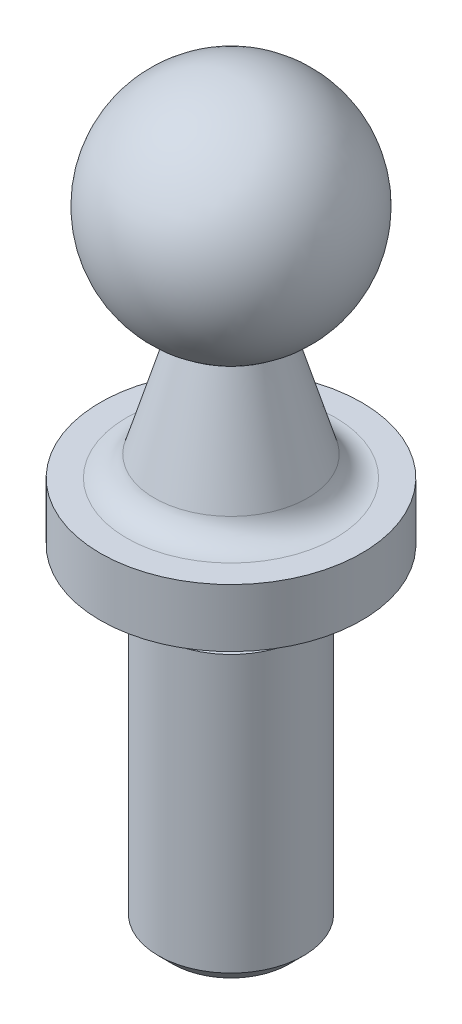
ISO-10303-21;
HEADER;
FILE_DESCRIPTION(('STEP AP214'),'2;1');
FILE_NAME('part.step','',(''),(''),'','','');
FILE_SCHEMA(('AUTOMOTIVE_DESIGN { 1 0 10303 214 1 1 1 1 }'));
ENDSEC;
DATA;
#1=APPLICATION_CONTEXT('core data for automotive mechanical design processes');
#2=APPLICATION_PROTOCOL_DEFINITION('international standard','automotive_design',2000,#1);
#3=PRODUCT_CONTEXT('',#1,'mechanical');
#4=PRODUCT('Part','Part','',(#3));
#5=PRODUCT_RELATED_PRODUCT_CATEGORY('part','',(#4));
#6=PRODUCT_DEFINITION_FORMATION('','',#4);
#7=PRODUCT_DEFINITION_CONTEXT('part definition',#1,'design');
#8=PRODUCT_DEFINITION('design','',#6,#7);
#9=PRODUCT_DEFINITION_SHAPE('','',#8);
#10=(LENGTH_UNIT() NAMED_UNIT(*) SI_UNIT(.MILLI.,.METRE.));
#11=(NAMED_UNIT(*) PLANE_ANGLE_UNIT() SI_UNIT($,.RADIAN.));
#12=(NAMED_UNIT(*) SI_UNIT($,.STERADIAN.) SOLID_ANGLE_UNIT());
#13=UNCERTAINTY_MEASURE_WITH_UNIT(LENGTH_MEASURE(1.E-05),#10,'distance_accuracy_value','');
#14=(GEOMETRIC_REPRESENTATION_CONTEXT(3) GLOBAL_UNCERTAINTY_ASSIGNED_CONTEXT((#13)) GLOBAL_UNIT_ASSIGNED_CONTEXT((#10,
#11,#12)) REPRESENTATION_CONTEXT('',''));
#15=CARTESIAN_POINT('',(0.,0.,0.));
#16=DIRECTION('',(0.,0.,1.));
#17=DIRECTION('',(1.,0.,0.));
#18=AXIS2_PLACEMENT_3D('',#15,#16,#17);
#19=CARTESIAN_POINT('',(0.,-3.9,0.));
#20=DIRECTION('',(0.,1.,0.));
#21=DIRECTION('',(1.,0.,0.));
#22=AXIS2_PLACEMENT_3D('',#19,#20,#21);
#23=SPHERICAL_SURFACE('',#22,3.9);
#24=CARTESIAN_POINT('',(0.,-7.5,0.));
#25=DIRECTION('',(0.,1.,0.));
#26=DIRECTION('',(0.,0.,1.));
#27=AXIS2_PLACEMENT_3D('',#24,#25,#26);
#28=CIRCLE('',#27,1.5);
#29=CARTESIAN_POINT('',(0.,-7.5,1.5));
#30=VERTEX_POINT('',#29);
#31=EDGE_CURVE('E44',#30,#30,#28,.T.);
#32=ORIENTED_EDGE('',*,*,#31,.T.);
#33=EDGE_LOOP('',(#32));
#34=FACE_BOUND('',#33,.T.);
#35=ADVANCED_FACE('F25',(#34),#23,.T.);
#36=CARTESIAN_POINT('',(0.,-12.,0.));
#37=DIRECTION('',(0.,-1.,0.));
#38=DIRECTION('',(0.,0.,-1.));
#39=AXIS2_PLACEMENT_3D('',#36,#37,#38);
#40=CONICAL_SURFACE('',#39,2.85,0.291456794477867);
#41=CARTESIAN_POINT('',(0.,-11.2873478855663,0.));
#42=DIRECTION('',(0.,-1.,0.));
#43=DIRECTION('',(0.,0.,-1.));
#44=AXIS2_PLACEMENT_3D('',#41,#42,#43);
#45=CIRCLE('',#44,2.63620436566991);
#46=CARTESIAN_POINT('',(0.,-11.2873478855663,-2.63620436566991));
#47=VERTEX_POINT('',#46);
#48=EDGE_CURVE('E39',#47,#47,#45,.F.);
#49=ORIENTED_EDGE('',*,*,#48,.T.);
#50=EDGE_LOOP('',(#49));
#51=FACE_BOUND('',#50,.T.);
#52=ORIENTED_EDGE('',*,*,#31,.F.);
#53=EDGE_LOOP('',(#52));
#54=FACE_BOUND('',#53,.T.);
#55=ADVANCED_FACE('F79',(#51,#54),#40,.T.);
#56=CARTESIAN_POINT('',(2.85,-12.,0.));
#57=DIRECTION('',(0.,-1.,0.));
#58=DIRECTION('',(0.,0.,-1.));
#59=AXIS2_PLACEMENT_3D('',#56,#57,#58);
#60=PLANE('',#59);
#61=CARTESIAN_POINT('',(0.,-12.,0.));
#62=DIRECTION('',(0.,-1.,0.));
#63=DIRECTION('',(0.,0.,-1.));
#64=AXIS2_PLACEMENT_3D('',#61,#62,#63);
#65=CIRCLE('',#64,3.59403065089106);
#66=CARTESIAN_POINT('',(0.,-12.,-3.59403065089106));
#67=VERTEX_POINT('',#66);
#68=EDGE_CURVE('E35',#67,#67,#65,.T.);
#69=ORIENTED_EDGE('',*,*,#68,.T.);
#70=EDGE_LOOP('',(#69));
#71=FACE_BOUND('',#70,.T.);
#72=CARTESIAN_POINT('',(0.,-12.,0.));
#73=DIRECTION('',(0.,1.,0.));
#74=DIRECTION('',(0.,0.,1.));
#75=AXIS2_PLACEMENT_3D('',#72,#73,#74);
#76=CIRCLE('',#75,4.5);
#77=CARTESIAN_POINT('',(0.,-12.,4.5));
#78=VERTEX_POINT('',#77);
#79=EDGE_CURVE('E47',#78,#78,#76,.T.);
#80=ORIENTED_EDGE('',*,*,#79,.T.);
#81=EDGE_LOOP('',(#80));
#82=FACE_BOUND('',#81,.T.);
#83=ADVANCED_FACE('F84',(#71,#82),#60,.F.);
#84=CARTESIAN_POINT('',(0.,10.1876179194703,0.));
#85=DIRECTION('',(0.,1.,0.));
#86=DIRECTION('',(0.,0.,1.));
#87=AXIS2_PLACEMENT_3D('',#84,#85,#86);
#88=CYLINDRICAL_SURFACE('',#87,4.5);
#89=ORIENTED_EDGE('',*,*,#79,.F.);
#90=EDGE_LOOP('',(#89));
#91=FACE_BOUND('',#90,.T.);
#92=CARTESIAN_POINT('',(0.,-14.,0.));
#93=DIRECTION('',(0.,1.,0.));
#94=DIRECTION('',(0.,0.,1.));
#95=AXIS2_PLACEMENT_3D('',#92,#93,#94);
#96=CIRCLE('',#95,4.5);
#97=CARTESIAN_POINT('',(0.,-14.,4.5));
#98=VERTEX_POINT('',#97);
#99=EDGE_CURVE('E50',#98,#98,#96,.T.);
#100=ORIENTED_EDGE('',*,*,#99,.T.);
#101=EDGE_LOOP('',(#100));
#102=FACE_BOUND('',#101,.T.);
#103=ADVANCED_FACE('F91',(#91,#102),#88,.T.);
#104=CARTESIAN_POINT('',(2.5,-14.,0.));
#105=DIRECTION('',(0.,1.,0.));
#106=DIRECTION('',(0.,0.,1.));
#107=AXIS2_PLACEMENT_3D('',#104,#105,#106);
#108=PLANE('',#107);
#109=ORIENTED_EDGE('',*,*,#99,.F.);
#110=EDGE_LOOP('',(#109));
#111=FACE_BOUND('',#110,.T.);
#112=CARTESIAN_POINT('',(0.,-14.,0.));
#113=DIRECTION('',(0.,1.,0.));
#114=DIRECTION('',(0.,0.,1.));
#115=AXIS2_PLACEMENT_3D('',#112,#113,#114);
#116=CIRCLE('',#115,2.0024349269423);
#117=CARTESIAN_POINT('',(0.,-14.,2.0024349269423));
#118=VERTEX_POINT('',#117);
#119=EDGE_CURVE('E53',#118,#118,#116,.T.);
#120=ORIENTED_EDGE('',*,*,#119,.T.);
#121=EDGE_LOOP('',(#120));
#122=FACE_BOUND('',#121,.T.);
#123=ADVANCED_FACE('F97',(#111,#122),#108,.F.);
#124=CARTESIAN_POINT('',(0.,10.1876179194703,0.));
#125=DIRECTION('',(0.,1.,0.));
#126=DIRECTION('',(0.,0.,1.));
#127=AXIS2_PLACEMENT_3D('',#124,#125,#126);
#128=CYLINDRICAL_SURFACE('',#127,2.0024349269423);
#129=ORIENTED_EDGE('',*,*,#119,.F.);
#130=EDGE_LOOP('',(#129));
#131=FACE_BOUND('',#130,.T.);
#132=CARTESIAN_POINT('',(0.,-15.5,0.));
#133=DIRECTION('',(0.,1.,0.));
#134=DIRECTION('',(0.,0.,1.));
#135=AXIS2_PLACEMENT_3D('',#132,#133,#134);
#136=CIRCLE('',#135,2.0024349269423);
#137=CARTESIAN_POINT('',(0.,-15.5,2.0024349269423));
#138=VERTEX_POINT('',#137);
#139=EDGE_CURVE('E56',#138,#138,#136,.T.);
#140=ORIENTED_EDGE('',*,*,#139,.T.);
#141=EDGE_LOOP('',(#140));
#142=FACE_BOUND('',#141,.T.);
#143=ADVANCED_FACE('F75',(#131,#142),#128,.T.);
#144=CARTESIAN_POINT('',(2.0024349269423,-15.5,0.));
#145=DIRECTION('',(0.,-1.,0.));
#146=DIRECTION('',(0.,0.,-1.));
#147=AXIS2_PLACEMENT_3D('',#144,#145,#146);
#148=PLANE('',#147);
#149=ORIENTED_EDGE('',*,*,#139,.F.);
#150=EDGE_LOOP('',(#149));
#151=FACE_BOUND('',#150,.T.);
#152=CARTESIAN_POINT('',(0.,-15.5,0.));
#153=DIRECTION('',(0.,1.,0.));
#154=DIRECTION('',(0.,0.,1.));
#155=AXIS2_PLACEMENT_3D('',#152,#153,#154);
#156=CIRCLE('',#155,2.5);
#157=CARTESIAN_POINT('',(0.,-15.5,2.5));
#158=VERTEX_POINT('',#157);
#159=EDGE_CURVE('E59',#158,#158,#156,.T.);
#160=ORIENTED_EDGE('',*,*,#159,.T.);
#161=EDGE_LOOP('',(#160));
#162=FACE_BOUND('',#161,.T.);
#163=ADVANCED_FACE('F63',(#151,#162),#148,.F.);
#164=CARTESIAN_POINT('',(0.,10.1876179194703,0.));
#165=DIRECTION('',(0.,1.,0.));
#166=DIRECTION('',(0.,0.,1.));
#167=AXIS2_PLACEMENT_3D('',#164,#165,#166);
#168=CYLINDRICAL_SURFACE('',#167,2.5);
#169=CARTESIAN_POINT('',(0.,-25.,0.));
#170=DIRECTION('',(0.,1.,0.));
#171=DIRECTION('',(0.,0.,1.));
#172=AXIS2_PLACEMENT_3D('',#169,#170,#171);
#173=CIRCLE('',#172,2.5);
#174=CARTESIAN_POINT('',(0.,-25.,2.5));
#175=VERTEX_POINT('',#174);
#176=EDGE_CURVE('E31',#175,#175,#173,.T.);
#177=ORIENTED_EDGE('',*,*,#176,.T.);
#178=EDGE_LOOP('',(#177));
#179=FACE_BOUND('',#178,.T.);
#180=ORIENTED_EDGE('',*,*,#159,.F.);
#181=EDGE_LOOP('',(#180));
#182=FACE_BOUND('',#181,.T.);
#183=ADVANCED_FACE('F65',(#179,#182),#168,.T.);
#184=CARTESIAN_POINT('',(2.5,-25.5,0.));
#185=DIRECTION('',(0.,1.,0.));
#186=DIRECTION('',(0.,0.,1.));
#187=AXIS2_PLACEMENT_3D('',#184,#185,#186);
#188=PLANE('',#187);
#189=CARTESIAN_POINT('',(0.,-25.5,0.));
#190=DIRECTION('',(0.,1.,0.));
#191=DIRECTION('',(0.,0.,1.));
#192=AXIS2_PLACEMENT_3D('',#189,#190,#191);
#193=CIRCLE('',#192,2.00000000000001);
#194=CARTESIAN_POINT('',(0.,-25.5,2.00000000000001));
#195=VERTEX_POINT('',#194);
#196=EDGE_CURVE('E10',#195,#195,#193,.F.);
#197=ORIENTED_EDGE('',*,*,#196,.T.);
#198=EDGE_LOOP('',(#197));
#199=FACE_BOUND('',#198,.T.);
#200=ADVANCED_FACE('F67',(#199),#188,.F.);
#201=CARTESIAN_POINT('',(0.,-11.,0.));
#202=DIRECTION('',(0.,-1.,0.));
#203=DIRECTION('',(0.,0.,-1.));
#204=AXIS2_PLACEMENT_3D('',#201,#202,#203);
#205=TOROIDAL_SURFACE('',#204,3.59403065089106,1.);
#206=ORIENTED_EDGE('',*,*,#68,.F.);
#207=EDGE_LOOP('',(#206));
#208=FACE_BOUND('',#207,.T.);
#209=ORIENTED_EDGE('',*,*,#48,.F.);
#210=EDGE_LOOP('',(#209));
#211=FACE_BOUND('',#210,.T.);
#212=ADVANCED_FACE('F73',(#208,#211),#205,.F.);
#213=CARTESIAN_POINT('',(0.,-25.,0.));
#214=DIRECTION('',(0.,1.,0.));
#215=DIRECTION('',(0.,0.,1.));
#216=AXIS2_PLACEMENT_3D('',#213,#214,#215);
#217=CONICAL_SURFACE('',#216,2.5,0.785398163397452);
#218=ORIENTED_EDGE('',*,*,#196,.F.);
#219=EDGE_LOOP('',(#218));
#220=FACE_BOUND('',#219,.T.);
#221=ORIENTED_EDGE('',*,*,#176,.F.);
#222=EDGE_LOOP('',(#221));
#223=FACE_BOUND('',#222,.T.);
#224=ADVANCED_FACE('F119',(#220,#223),#217,.T.);
#225=CLOSED_SHELL('',(#35,#55,#83,#103,#123,#143,#163,#183,#200,#212,#224));
#226=MANIFOLD_SOLID_BREP('B2',#225);
#227=ADVANCED_BREP_SHAPE_REPRESENTATION('',(#18,#226),#14);
#228=SHAPE_DEFINITION_REPRESENTATION(#9,#227);
ENDSEC;
END-ISO-10303-21;
